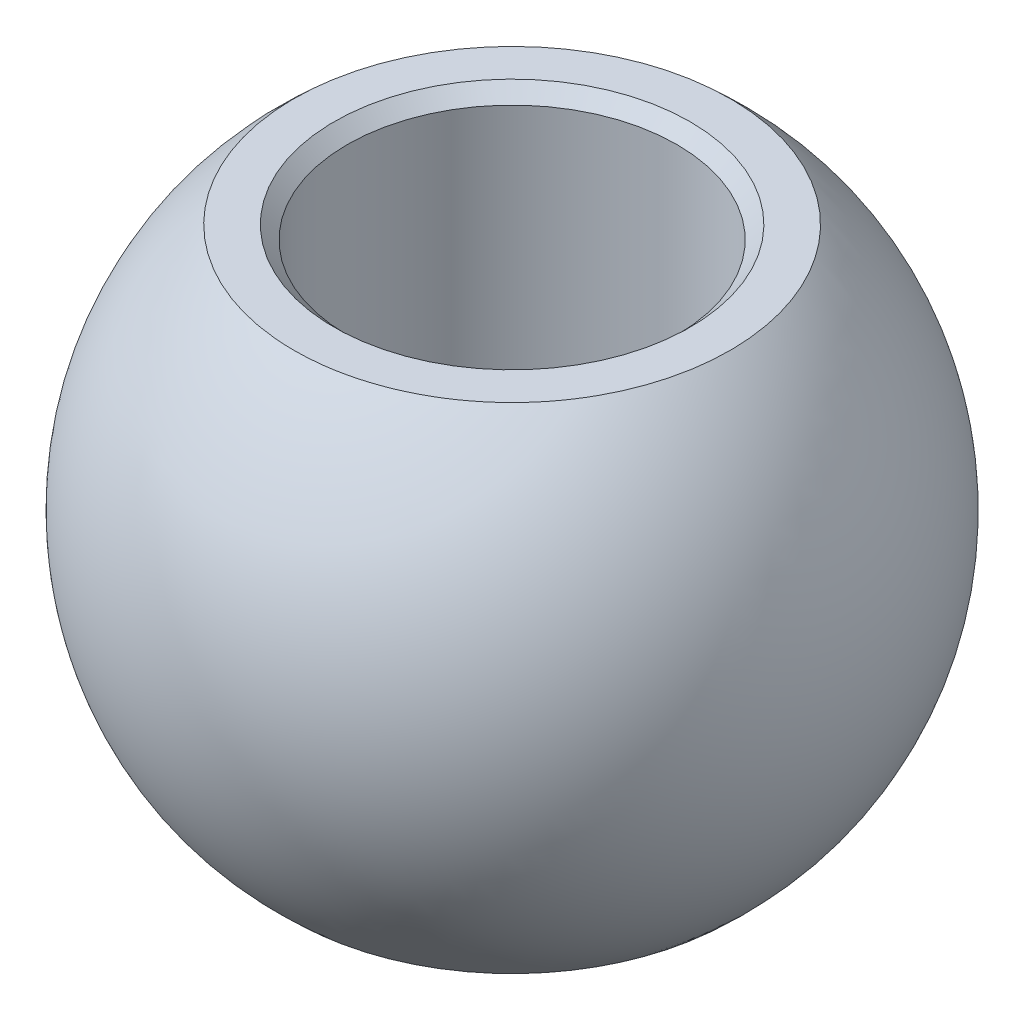
ISO-10303-21;
HEADER;
FILE_DESCRIPTION(('STEP AP214'),'2;1');
FILE_NAME('part.step','',(''),(''),'','','');
FILE_SCHEMA(('AUTOMOTIVE_DESIGN { 1 0 10303 214 1 1 1 1 }'));
ENDSEC;
DATA;
#1=APPLICATION_CONTEXT('core data for automotive mechanical design processes');
#2=APPLICATION_PROTOCOL_DEFINITION('international standard','automotive_design',2000,#1);
#3=PRODUCT_CONTEXT('',#1,'mechanical');
#4=PRODUCT('Part','Part','',(#3));
#5=PRODUCT_RELATED_PRODUCT_CATEGORY('part','',(#4));
#6=PRODUCT_DEFINITION_FORMATION('','',#4);
#7=PRODUCT_DEFINITION_CONTEXT('part definition',#1,'design');
#8=PRODUCT_DEFINITION('design','',#6,#7);
#9=PRODUCT_DEFINITION_SHAPE('','',#8);
#10=(LENGTH_UNIT() NAMED_UNIT(*) SI_UNIT(.MILLI.,.METRE.));
#11=(NAMED_UNIT(*) PLANE_ANGLE_UNIT() SI_UNIT($,.RADIAN.));
#12=(NAMED_UNIT(*) SI_UNIT($,.STERADIAN.) SOLID_ANGLE_UNIT());
#13=UNCERTAINTY_MEASURE_WITH_UNIT(LENGTH_MEASURE(1.E-05),#10,'distance_accuracy_value','');
#14=(GEOMETRIC_REPRESENTATION_CONTEXT(3) GLOBAL_UNCERTAINTY_ASSIGNED_CONTEXT((#13)) GLOBAL_UNIT_ASSIGNED_CONTEXT((#10,
#11,#12)) REPRESENTATION_CONTEXT('',''));
#15=CARTESIAN_POINT('',(0.,0.,0.));
#16=DIRECTION('',(0.,0.,1.));
#17=DIRECTION('',(1.,0.,0.));
#18=AXIS2_PLACEMENT_3D('',#15,#16,#17);
#19=CARTESIAN_POINT('',(0.,4.7625,39.6748));
#20=DIRECTION('',(0.,-1.,0.));
#21=DIRECTION('',(0.,0.,-1.));
#22=AXIS2_PLACEMENT_3D('',#19,#20,#21);
#23=PLANE('',#22);
#24=CARTESIAN_POINT('',(0.,4.7625,39.6748));
#25=DIRECTION('',(0.,-1.,0.));
#26=DIRECTION('',(0.,0.,-1.));
#27=AXIS2_PLACEMENT_3D('',#24,#25,#26);
#28=CIRCLE('',#27,3.42899999998385);
#29=CARTESIAN_POINT('',(0.,4.7625,36.2458000000161));
#30=VERTEX_POINT('',#29);
#31=EDGE_CURVE('E12',#30,#30,#28,.T.);
#32=ORIENTED_EDGE('',*,*,#31,.T.);
#33=EDGE_LOOP('',(#32));
#34=FACE_BOUND('',#33,.T.);
#35=CARTESIAN_POINT('',(0.,4.7625,43.874930206315));
#36=CARTESIAN_POINT('',(-0.117926484560648,4.7625,43.8749294996594));
#37=CARTESIAN_POINT('',(-0.235874641254159,4.7625,43.8699592573751));
#38=CARTESIAN_POINT('',(-0.470955861004184,4.7625,43.8501106007492));
#39=CARTESIAN_POINT('',(-0.588088673100284,4.7625,43.8352292612048));
#40=CARTESIAN_POINT('',(-0.820881455214088,4.7625,43.7956253651789));
#41=CARTESIAN_POINT('',(-0.936538785047837,4.7625,43.770887186888));
#42=CARTESIAN_POINT('',(-1.16542262835763,4.7625,43.7117401250278));
#43=CARTESIAN_POINT('',(-1.27864708861528,4.7625,43.6773233936185));
#44=CARTESIAN_POINT('',(-1.61297348901639,4.7625,43.5600312715043));
#45=CARTESIAN_POINT('',(-1.82929109201933,4.7625,43.4630176106887));
#46=CARTESIAN_POINT('',(-2.24254482911472,4.7625,43.2339987536841));
#47=CARTESIAN_POINT('',(-2.43948022604492,4.7625,43.1019922273182));
#48=CARTESIAN_POINT('',(-2.71606737206159,4.7625,42.8807445651986));
#49=CARTESIAN_POINT('',(-2.80517919807281,4.7625,42.8030639527833));
#50=CARTESIAN_POINT('',(-2.97648149360182,4.7625,42.6405310172082));
#51=CARTESIAN_POINT('',(-3.05867855351258,4.7625,42.5556856808685));
#52=CARTESIAN_POINT('',(-3.21566582479757,4.7625,42.3793397846612));
#53=CARTESIAN_POINT('',(-3.29045266406456,4.7625,42.2878362274435));
#54=CARTESIAN_POINT('',(-3.43207083285624,4.7625,42.0988316530998));
#55=CARTESIAN_POINT('',(-3.49890031578301,4.76249999999999,42.0013292518029));
#56=CARTESIAN_POINT('',(-3.62408488645376,4.76249999999999,41.8010740012385));
#57=CARTESIAN_POINT('',(-3.68244282868453,4.7625,41.6983229363588));
#58=CARTESIAN_POINT('',(-3.79031685235155,4.7625,41.4882338986538));
#59=CARTESIAN_POINT('',(-3.83982966775092,4.7625,41.3808942495633));
#60=CARTESIAN_POINT('',(-3.92961805965569,4.7625,41.1624585614712));
#61=CARTESIAN_POINT('',(-3.96989715669366,4.7625,41.051363972712));
#62=CARTESIAN_POINT('',(-4.04096740989928,4.7625,40.8261648063783));
#63=CARTESIAN_POINT('',(-4.07175500997036,4.76249999999998,40.712059118001));
#64=CARTESIAN_POINT('',(-4.1494826483622,4.76249999999998,40.3665383252836));
#65=CARTESIAN_POINT('',(-4.18188464233577,4.7625,40.1316825546638));
#66=CARTESIAN_POINT('',(-4.20674194830698,4.76249999999999,39.6598664500431));
#67=CARTESIAN_POINT('',(-4.19919726030462,4.76249999999995,39.4229061160422));
#68=CARTESIAN_POINT('',(-4.15820619108131,4.76249999999997,39.0711307101168));
#69=CARTESIAN_POINT('',(-4.13957890770973,4.76249999999999,38.9544216326961));
#70=CARTESIAN_POINT('',(-4.09256533770934,4.7625,38.7230013016016));
#71=CARTESIAN_POINT('',(-4.06418270421069,4.7625,38.608289316938));
#72=CARTESIAN_POINT('',(-3.99784393162879,4.7625,38.3816281768953));
#73=CARTESIAN_POINT('',(-3.95988413911526,4.76250000000002,38.2696800938033));
#74=CARTESIAN_POINT('',(-3.8746828144652,4.76249999999998,38.0494190145728));
#75=CARTESIAN_POINT('',(-3.82744470642194,4.76249999999992,37.941104694634));
#76=CARTESIAN_POINT('',(-3.72399535984851,4.76249999999993,37.7288040238715));
#77=CARTESIAN_POINT('',(-3.66778109513568,4.76249999999998,37.6248191476168));
#78=CARTESIAN_POINT('',(-3.54680693840993,4.76250000000002,37.4219800777628));
#79=CARTESIAN_POINT('',(-3.48204902821681,4.76249999999999,37.3231247016902));
#80=CARTESIAN_POINT('',(-3.34446071544949,4.7625,37.1312592940615));
#81=CARTESIAN_POINT('',(-3.2716339812673,4.76250000000003,37.0382466360792));
#82=CARTESIAN_POINT('',(-3.11835846692702,4.76249999999997,36.8586135425138));
#83=CARTESIAN_POINT('',(-3.0379023987059,4.76249999999987,36.7719993625739));
#84=CARTESIAN_POINT('',(-2.78609444631257,4.76249999999979,36.5229135692285));
#85=CARTESIAN_POINT('',(-2.6041201106219,4.76250000000003,36.3709444450052));
#86=CARTESIAN_POINT('',(-2.21721871431337,4.76249999999997,36.0997699668154));
#87=CARTESIAN_POINT('',(-2.01229252654783,4.76249999999966,35.9805633674945));
#88=CARTESIAN_POINT('',(-1.69214162632169,4.7624999999998,35.8287905603135));
#89=CARTESIAN_POINT('',(-1.58316037186452,4.76249999999995,35.7826670741218));
#90=CARTESIAN_POINT('',(-1.36175860205066,4.76250000000005,35.6997970253812));
#91=CARTESIAN_POINT('',(-1.24934095317315,4.76249999999999,35.6630428741833));
#92=CARTESIAN_POINT('',(-1.02199834753086,4.76250000000001,35.5991970626959));
#93=CARTESIAN_POINT('',(-0.907077657826551,4.76250000000008,35.5720901445003));
#94=CARTESIAN_POINT('',(-0.67538346253265,4.76249999999992,35.5276497471559));
#95=CARTESIAN_POINT('',(-0.558610513885609,4.76249999999968,35.5103133853682));
#96=CARTESIAN_POINT('',(-0.36804714736754,4.76249999999978,35.4901769434643));
#97=CARTESIAN_POINT('',(-0.294561834944511,4.76249999999994,35.4843636025291));
#98=CARTESIAN_POINT('',(-0.147387169762472,4.76250000000006,35.4766098068282));
#99=CARTESIAN_POINT('',(-0.0736978170034627,4.76250000000002,35.4746693520625));
#100=CARTESIAN_POINT('',(0.117926484560658,4.76249999999997,35.4746705003406));
#101=CARTESIAN_POINT('',(0.235874641254178,4.76249999999999,35.4796407426249));
#102=CARTESIAN_POINT('',(0.470955861004222,4.76250000000001,35.4994893992508));
#103=CARTESIAN_POINT('',(0.588088673100333,4.76249999999999,35.5143707387953));
#104=CARTESIAN_POINT('',(0.820881455214148,4.7625,35.5539746348211));
#105=CARTESIAN_POINT('',(0.936538785047899,4.76250000000003,35.578712813112));
#106=CARTESIAN_POINT('',(1.16542262835771,4.76249999999997,35.6378598749722));
#107=CARTESIAN_POINT('',(1.27864708861537,4.76249999999989,35.6722766063815));
#108=CARTESIAN_POINT('',(1.61297348901651,4.76249999999981,35.7895687284957));
#109=CARTESIAN_POINT('',(1.82929109201943,4.76249999999998,35.8865823893113));
#110=CARTESIAN_POINT('',(2.24254482911484,4.76250000000002,36.115601246316));
#111=CARTESIAN_POINT('',(2.43948022604509,4.76249999999989,36.2476077726818));
#112=CARTESIAN_POINT('',(2.71606737206175,4.76249999999993,36.4688554348015));
#113=CARTESIAN_POINT('',(2.80517919807295,4.76249999999998,36.5465360472168));
#114=CARTESIAN_POINT('',(2.97648149360194,4.76250000000002,36.7090689827919));
#115=CARTESIAN_POINT('',(3.0586785535127,4.7625,36.7939143191316));
#116=CARTESIAN_POINT('',(3.21566582479769,4.7625,36.970260215339));
#117=CARTESIAN_POINT('',(3.29045266406469,4.76250000000001,37.0617637725567));
#118=CARTESIAN_POINT('',(3.43207083285636,4.76249999999999,37.2507683469003));
#119=CARTESIAN_POINT('',(3.49890031578313,4.76249999999996,37.3482707481972));
#120=CARTESIAN_POINT('',(3.62408488645387,4.76249999999996,37.5485259987617));
#121=CARTESIAN_POINT('',(3.68244282868462,4.76249999999999,37.6512770636414));
#122=CARTESIAN_POINT('',(3.79031685235163,4.76250000000001,37.8613661013464));
#123=CARTESIAN_POINT('',(3.839829667751,4.7625,37.9687057504369));
#124=CARTESIAN_POINT('',(3.92961805965576,4.7625,38.187141438529));
#125=CARTESIAN_POINT('',(3.96989715669373,4.7625,38.2982360272882));
#126=CARTESIAN_POINT('',(4.04096740989934,4.76249999999999,38.5234351936219));
#127=CARTESIAN_POINT('',(4.07175500997042,4.76249999999998,38.6375408819992));
#128=CARTESIAN_POINT('',(4.14948264836224,4.76249999999996,38.9830616747166));
#129=CARTESIAN_POINT('',(4.1818846423358,4.76249999999999,39.2179174453364));
#130=CARTESIAN_POINT('',(4.20674194830698,4.76250000000001,39.6897335499571));
#131=CARTESIAN_POINT('',(4.19919726030458,4.76249999999999,39.926693883958));
#132=CARTESIAN_POINT('',(4.15820619108126,4.76249999999999,40.2784692898834));
#133=CARTESIAN_POINT('',(4.13957890770969,4.7625,40.3951783673041));
#134=CARTESIAN_POINT('',(4.0925653377093,4.7625,40.6265986983986));
#135=CARTESIAN_POINT('',(4.06418270421063,4.7625,40.7413106830622));
#136=CARTESIAN_POINT('',(3.99784393162873,4.7625,40.9679718231049));
#137=CARTESIAN_POINT('',(3.9598841391152,4.7625,41.0799199061969));
#138=CARTESIAN_POINT('',(3.8746828144651,4.7625,41.3001809854274));
#139=CARTESIAN_POINT('',(3.82744470642181,4.76249999999999,41.4084953053662));
#140=CARTESIAN_POINT('',(3.72399535984838,4.76249999999999,41.6207959761287));
#141=CARTESIAN_POINT('',(3.66778109513556,4.7625,41.7247808523834));
#142=CARTESIAN_POINT('',(3.54680693840981,4.7625,41.9276199222374));
#143=CARTESIAN_POINT('',(3.48204902821668,4.7625,42.02647529831));
#144=CARTESIAN_POINT('',(3.34446071544936,4.7625,42.2183407059387));
#145=CARTESIAN_POINT('',(3.27163398126717,4.7625,42.311353363921));
#146=CARTESIAN_POINT('',(3.11835846692685,4.7625,42.4909864574864));
#147=CARTESIAN_POINT('',(3.03790239870568,4.7625,42.5776006374262));
#148=CARTESIAN_POINT('',(2.7860944463123,4.7625,42.8266864307716));
#149=CARTESIAN_POINT('',(2.60412011062172,4.7625,42.978655554995));
#150=CARTESIAN_POINT('',(2.21721871431317,4.7625,43.2498300331848));
#151=CARTESIAN_POINT('',(2.01229252654752,4.7625,43.3690366325055));
#152=CARTESIAN_POINT('',(1.6921416263214,4.7625,43.5208094396866));
#153=CARTESIAN_POINT('',(1.58316037186425,4.7625,43.5669329258783));
#154=CARTESIAN_POINT('',(1.36175860205042,4.7625,43.6498029746189));
#155=CARTESIAN_POINT('',(1.2493409531729,4.7625,43.6865571258168));
#156=CARTESIAN_POINT('',(1.02199834753061,4.7625,43.7504029373042));
#157=CARTESIAN_POINT('',(0.907077657826312,4.7625,43.7775098554998));
#158=CARTESIAN_POINT('',(0.675383462532398,4.7625,43.8219502528441));
#159=CARTESIAN_POINT('',(0.558610513885334,4.7625,43.8392866146317));
#160=CARTESIAN_POINT('',(0.368047147367306,4.7625,43.8594230565356));
#161=CARTESIAN_POINT('',(0.294561834944329,4.7625,43.8652363974709));
#162=CARTESIAN_POINT('',(0.147387169762386,4.7625,43.8729901931718));
#163=CARTESIAN_POINT('',(0.073697817003421,4.7625,43.8749306479375));
#164=CARTESIAN_POINT('',(0.,4.7625,43.874930206315));
#165=B_SPLINE_CURVE_WITH_KNOTS('',3,(#35,#36,#37,#38,#39,#40,#41,#42,#43,#44,#45,#46,#47,#48,
#49,#50,#51,#52,#53,#54,#55,#56,#57,#58,#59,#60,#61,#62,#63,#64,#65,#66,#67,#68,#69,#70,#71,#72,
#73,#74,#75,#76,#77,#78,#79,#80,#81,#82,#83,#84,#85,#86,#87,#88,#89,#90,#91,#92,#93,#94,#95,#96,
#97,#98,#99,#100,#101,#102,#103,#104,#105,#106,#107,#108,#109,#110,#111,#112,#113,#114,#115,
#116,#117,#118,#119,#120,#121,#122,#123,#124,#125,#126,#127,#128,#129,#130,#131,#132,#133,#134,
#135,#136,#137,#138,#139,#140,#141,#142,#143,#144,#145,#146,#147,#148,#149,#150,#151,#152,#153,
#154,#155,#156,#157,#158,#159,#160,#161,#162,#163,#164),.UNSPECIFIED.,.T.,.F.,(4,2,2,2,2,2,2,2,
2,2,2,2,2,2,2,2,2,2,2,2,2,2,2,2,2,2,2,2,2,2,2,2,2,2,2,2,2,2,2,2,2,2,2,2,2,2,2,2,2,2,2,2,2,2,2,2,
2,2,2,2,2,2,2,2,4),(0.,0.353711607909462,0.707527658036076,1.06190670544321,1.41657393321628,
2.12421773198894,2.8318884341422,3.18618744171492,3.54014485168143,3.89426260138645,
4.24846236876854,4.60254251007932,4.95675312540429,5.31082846567948,5.66503630351361,
6.37269355397748,7.08035080444134,7.43455864227549,7.78863398255066,8.14284459787563,
8.49692473918641,8.85112450656849,9.20524225627351,9.55919966624002,9.91349867381274,
10.621169375966,11.3288131747386,11.6834804025117,12.0378594499189,12.3916755000455,
12.7453871079549,12.9664381589452,13.1874892099354,13.5412008178449,13.8950168679715,
14.2493959153787,14.6040631431517,15.3117069419244,16.0193776440778,16.3736766516505,
16.727634061617,17.081751811322,17.4359515787041,17.7900317200149,18.1442423353399,
18.4983176756151,18.8525255134492,19.5601827639131,20.267840014377,20.6220478522111,
20.9761231924863,21.3303338078112,21.684413949122,22.0386137165041,22.3927314662091,
22.7466888761756,23.1009878837484,23.8086585859016,24.5163023846743,24.8709696124474,
25.2253486598545,25.5791647099811,25.9328763178905,26.1539273688806,26.3749784198707),.UNSPECIFIED.);
#166=CARTESIAN_POINT('',(0.,4.7625,43.874930206315));
#167=VERTEX_POINT('',#166);
#168=EDGE_CURVE('E82',#167,#167,#165,.T.);
#169=ORIENTED_EDGE('',*,*,#168,.F.);
#170=EDGE_LOOP('',(#169));
#171=FACE_BOUND('',#170,.T.);
#172=ADVANCED_FACE('F41',(#34,#171),#23,.F.);
#173=CARTESIAN_POINT('',(0.,-4.7625,39.6748));
#174=DIRECTION('',(0.,1.,0.));
#175=DIRECTION('',(0.,0.,1.));
#176=AXIS2_PLACEMENT_3D('',#173,#174,#175);
#177=PLANE('',#176);
#178=CARTESIAN_POINT('',(0.,-4.7625,39.6748));
#179=DIRECTION('',(0.,1.,0.));
#180=DIRECTION('',(0.,0.,1.));
#181=AXIS2_PLACEMENT_3D('',#178,#179,#180);
#182=CIRCLE('',#181,3.42899999998385);
#183=CARTESIAN_POINT('',(0.,-4.7625,43.1037999999838));
#184=VERTEX_POINT('',#183);
#185=EDGE_CURVE('E94',#184,#184,#182,.T.);
#186=ORIENTED_EDGE('',*,*,#185,.T.);
#187=EDGE_LOOP('',(#186));
#188=FACE_BOUND('',#187,.T.);
#189=CARTESIAN_POINT('',(0.,-4.7625,35.474669793685));
#190=CARTESIAN_POINT('',(-0.117926484560649,-4.76249999999999,35.4746705003406));
#191=CARTESIAN_POINT('',(-0.235874641254159,-4.7625,35.4796407426249));
#192=CARTESIAN_POINT('',(-0.470955861004182,-4.7625,35.4994893992508));
#193=CARTESIAN_POINT('',(-0.588088673100283,-4.7625,35.5143707387952));
#194=CARTESIAN_POINT('',(-0.820881455214087,-4.7625,35.5539746348211));
#195=CARTESIAN_POINT('',(-0.936538785047836,-4.7625,35.578712813112));
#196=CARTESIAN_POINT('',(-1.16542262835763,-4.7625,35.6378598749722));
#197=CARTESIAN_POINT('',(-1.27864708861528,-4.76249999999999,35.6722766063815));
#198=CARTESIAN_POINT('',(-1.61297348901639,-4.76249999999999,35.7895687284958));
#199=CARTESIAN_POINT('',(-1.82929109201934,-4.7625,35.8865823893113));
#200=CARTESIAN_POINT('',(-2.24254482911472,-4.7625,36.1156012463159));
#201=CARTESIAN_POINT('',(-2.43948022604491,-4.7625,36.2476077726818));
#202=CARTESIAN_POINT('',(-2.71606737206159,-4.7625,36.4688554348014));
#203=CARTESIAN_POINT('',(-2.80517919807282,-4.7625,36.5465360472167));
#204=CARTESIAN_POINT('',(-2.97648149360182,-4.7625,36.7090689827918));
#205=CARTESIAN_POINT('',(-3.05867855351258,-4.7625,36.7939143191315));
#206=CARTESIAN_POINT('',(-3.21566582479757,-4.7625,36.9702602153388));
#207=CARTESIAN_POINT('',(-3.29045266406457,-4.7625,37.0617637725565));
#208=CARTESIAN_POINT('',(-3.43207083285624,-4.7625,37.2507683469002));
#209=CARTESIAN_POINT('',(-3.498900315783,-4.7625,37.3482707481971));
#210=CARTESIAN_POINT('',(-3.62408488645375,-4.7625,37.5485259987615));
#211=CARTESIAN_POINT('',(-3.68244282868452,-4.7625,37.6512770636412));
#212=CARTESIAN_POINT('',(-3.79031685235155,-4.7625,37.8613661013462));
#213=CARTESIAN_POINT('',(-3.83982966775091,-4.7625,37.9687057504367));
#214=CARTESIAN_POINT('',(-3.92961805965569,-4.7625,38.1871414385288));
#215=CARTESIAN_POINT('',(-3.96989715669366,-4.7625,38.298236027288));
#216=CARTESIAN_POINT('',(-4.04096740989928,-4.7625,38.5234351936217));
#217=CARTESIAN_POINT('',(-4.07175500997036,-4.7625,38.637540881999));
#218=CARTESIAN_POINT('',(-4.14948264836218,-4.7625,38.9830616747165));
#219=CARTESIAN_POINT('',(-4.18188464233577,-4.7625,39.2179174453362));
#220=CARTESIAN_POINT('',(-4.20674194830698,-4.7625,39.6897335499569));
#221=CARTESIAN_POINT('',(-4.1991972603046,-4.7625,39.9266938839578));
#222=CARTESIAN_POINT('',(-4.15820619108129,-4.7625,40.2784692898832));
#223=CARTESIAN_POINT('',(-4.13957890770972,-4.7625,40.3951783673039));
#224=CARTESIAN_POINT('',(-4.09256533770934,-4.7625,40.6265986983984));
#225=CARTESIAN_POINT('',(-4.06418270421069,-4.7625,40.741310683062));
#226=CARTESIAN_POINT('',(-3.9978439316288,-4.7625,40.9679718231047));
#227=CARTESIAN_POINT('',(-3.95988413911527,-4.7625,41.0799199061967));
#228=CARTESIAN_POINT('',(-3.87468281446519,-4.76249999999999,41.3001809854272));
#229=CARTESIAN_POINT('',(-3.82744470642191,-4.76249999999998,41.408495305366));
#230=CARTESIAN_POINT('',(-3.72399535984848,-4.76249999999998,41.6207959761285));
#231=CARTESIAN_POINT('',(-3.66778109513566,-4.76249999999999,41.7247808523832));
#232=CARTESIAN_POINT('',(-3.54680693840992,-4.7625,41.9276199222372));
#233=CARTESIAN_POINT('',(-3.48204902821679,-4.7625,42.0264752983098));
#234=CARTESIAN_POINT('',(-3.34446071544948,-4.7625,42.2183407059385));
#235=CARTESIAN_POINT('',(-3.27163398126729,-4.7625,42.3113533639208));
#236=CARTESIAN_POINT('',(-3.11835846692698,-4.7625,42.4909864574862));
#237=CARTESIAN_POINT('',(-3.03790239870582,-4.76249999999999,42.5776006374261));
#238=CARTESIAN_POINT('',(-2.78609444631246,-4.76249999999998,42.8266864307715));
#239=CARTESIAN_POINT('',(-2.60412011062187,-4.76250000000001,42.9786555549949));
#240=CARTESIAN_POINT('',(-2.21721871431333,-4.76249999999999,43.2498300331846));
#241=CARTESIAN_POINT('',(-2.0122925265477,-4.76249999999995,43.3690366325054));
#242=CARTESIAN_POINT('',(-1.69214162632159,-4.76249999999997,43.5208094396865));
#243=CARTESIAN_POINT('',(-1.58316037186444,-4.76249999999999,43.5669329258782));
#244=CARTESIAN_POINT('',(-1.3617586020506,-4.7625,43.6498029746188));
#245=CARTESIAN_POINT('',(-1.24934095317309,-4.7625,43.6865571258167));
#246=CARTESIAN_POINT('',(-1.0219983475308,-4.7625,43.7504029373041));
#247=CARTESIAN_POINT('',(-0.907077657826499,-4.76250000000002,43.7775098554997));
#248=CARTESIAN_POINT('',(-0.675383462532587,-4.76249999999998,43.821950252844));
#249=CARTESIAN_POINT('',(-0.558610513885528,-4.76249999999992,43.8392866146317));
#250=CARTESIAN_POINT('',(-0.368047147367467,-4.76249999999995,43.8594230565356));
#251=CARTESIAN_POINT('',(-0.294561834944455,-4.76249999999998,43.8652363974709));
#252=CARTESIAN_POINT('',(-0.147387169762445,-4.76250000000002,43.8729901931718));
#253=CARTESIAN_POINT('',(-0.0736978170034471,-4.76250000000001,43.8749306479375));
#254=CARTESIAN_POINT('',(0.117926484560652,-4.7625,43.8749294996594));
#255=CARTESIAN_POINT('',(0.23587464125416,-4.7625,43.8699592573751));
#256=CARTESIAN_POINT('',(0.470955861004181,-4.7625,43.8501106007492));
#257=CARTESIAN_POINT('',(0.588088673100281,-4.76249999999999,43.8352292612048));
#258=CARTESIAN_POINT('',(0.820881455214073,-4.76250000000001,43.7956253651789));
#259=CARTESIAN_POINT('',(0.936538785047813,-4.76250000000004,43.770887186888));
#260=CARTESIAN_POINT('',(1.16542262835761,-4.76249999999996,43.7117401250278));
#261=CARTESIAN_POINT('',(1.27864708861528,-4.76249999999985,43.6773233936186));
#262=CARTESIAN_POINT('',(1.61297348901639,-4.76249999999976,43.5600312715044));
#263=CARTESIAN_POINT('',(1.82929109201926,-4.76250000000003,43.4630176106887));
#264=CARTESIAN_POINT('',(2.24254482911467,-4.76249999999997,43.2339987536842));
#265=CARTESIAN_POINT('',(2.43948022604496,-4.76249999999965,43.1019922273184));
#266=CARTESIAN_POINT('',(2.71606737206156,-4.7624999999998,42.8807445651988));
#267=CARTESIAN_POINT('',(2.80517919807273,-4.76249999999995,42.8030639527835));
#268=CARTESIAN_POINT('',(2.97648149360171,-4.76250000000005,42.6405310172083));
#269=CARTESIAN_POINT('',(3.0586785535125,-4.7625,42.5556856808686));
#270=CARTESIAN_POINT('',(3.21566582479749,-4.7625,42.3793397846613));
#271=CARTESIAN_POINT('',(3.29045266406447,-4.76250000000006,42.2878362274435));
#272=CARTESIAN_POINT('',(3.43207083285621,-4.76249999999994,42.0988316530999));
#273=CARTESIAN_POINT('',(3.49890031578306,-4.76249999999975,42.0013292518031));
#274=CARTESIAN_POINT('',(3.62408488645381,-4.76249999999975,41.8010740012386));
#275=CARTESIAN_POINT('',(3.68244282868449,-4.76249999999994,41.6983229363589));
#276=CARTESIAN_POINT('',(3.79031685235147,-4.76250000000006,41.4882338986539));
#277=CARTESIAN_POINT('',(3.83982966775087,-4.76250000000001,41.3808942495634));
#278=CARTESIAN_POINT('',(3.92961805965566,-4.76249999999999,41.1624585614713));
#279=CARTESIAN_POINT('',(3.96989715669361,-4.76250000000003,41.051363972712));
#280=CARTESIAN_POINT('',(4.04096740989927,-4.76249999999997,40.8261648063784));
#281=CARTESIAN_POINT('',(4.0717550099704,-4.76249999999988,40.7120591180011));
#282=CARTESIAN_POINT('',(4.1494826483623,-4.76249999999978,40.3665383252837));
#283=CARTESIAN_POINT('',(4.18188464233578,-4.76249999999997,40.1316825546639));
#284=CARTESIAN_POINT('',(4.20674194830696,-4.76250000000003,39.6598664500432));
#285=CARTESIAN_POINT('',(4.19919726030466,-4.7624999999999,39.4229061160423));
#286=CARTESIAN_POINT('',(4.15820619108134,-4.76249999999993,39.0711307101169));
#287=CARTESIAN_POINT('',(4.13957890770974,-4.76249999999998,38.9544216326961));
#288=CARTESIAN_POINT('',(4.09256533770935,-4.76250000000002,38.7230013016016));
#289=CARTESIAN_POINT('',(4.0641827042107,-4.7625,38.608289316938));
#290=CARTESIAN_POINT('',(3.99784393162881,-4.7625,38.3816281768954));
#291=CARTESIAN_POINT('',(3.95988413911528,-4.76250000000001,38.2696800938034));
#292=CARTESIAN_POINT('',(3.8746828144652,-4.76249999999999,38.0494190145728));
#293=CARTESIAN_POINT('',(3.82744470642194,-4.76249999999995,37.941104694634));
#294=CARTESIAN_POINT('',(3.72399535984851,-4.76249999999995,37.7288040238716));
#295=CARTESIAN_POINT('',(3.66778109513569,-4.76249999999999,37.6248191476168));
#296=CARTESIAN_POINT('',(3.54680693840994,-4.76250000000001,37.4219800777628));
#297=CARTESIAN_POINT('',(3.48204902821681,-4.7625,37.3231247016902));
#298=CARTESIAN_POINT('',(3.3444607154495,-4.7625,37.1312592940615));
#299=CARTESIAN_POINT('',(3.27163398126731,-4.7625,37.0382466360792));
#300=CARTESIAN_POINT('',(3.118358466927,-4.76249999999999,36.8586135425138));
#301=CARTESIAN_POINT('',(3.03790239870585,-4.76249999999998,36.7719993625739));
#302=CARTESIAN_POINT('',(2.78609444631249,-4.76249999999996,36.5229135692285));
#303=CARTESIAN_POINT('',(2.6041201106219,-4.76249999999999,36.3709444450052));
#304=CARTESIAN_POINT('',(2.21721871431336,-4.7625,36.0997699668154));
#305=CARTESIAN_POINT('',(2.01229252654772,-4.76249999999998,35.9805633674946));
#306=CARTESIAN_POINT('',(1.69214162632161,-4.76249999999999,35.8287905603135));
#307=CARTESIAN_POINT('',(1.58316037186446,-4.7625,35.7826670741218));
#308=CARTESIAN_POINT('',(1.36175860205063,-4.7625,35.6997970253812));
#309=CARTESIAN_POINT('',(1.24934095317311,-4.7625,35.6630428741833));
#310=CARTESIAN_POINT('',(1.02199834753083,-4.7625,35.5991970626959));
#311=CARTESIAN_POINT('',(0.907077657826533,-4.7625,35.5720901445003));
#312=CARTESIAN_POINT('',(0.675383462532618,-4.7625,35.527649747156));
#313=CARTESIAN_POINT('',(0.558610513885552,-4.76249999999999,35.5103133853684));
#314=CARTESIAN_POINT('',(0.368047147367486,-4.76249999999999,35.4901769434644));
#315=CARTESIAN_POINT('',(0.294561834944473,-4.7625,35.4843636025291));
#316=CARTESIAN_POINT('',(0.147387169762458,-4.7625,35.4766098068282));
#317=CARTESIAN_POINT('',(0.0736978170034563,-4.7625,35.4746693520625));
#318=CARTESIAN_POINT('',(0.,-4.7625,35.474669793685));
#319=B_SPLINE_CURVE_WITH_KNOTS('',3,(#189,#190,#191,#192,#193,#194,#195,#196,#197,#198,#199,
#200,#201,#202,#203,#204,#205,#206,#207,#208,#209,#210,#211,#212,#213,#214,#215,#216,#217,#218,
#219,#220,#221,#222,#223,#224,#225,#226,#227,#228,#229,#230,#231,#232,#233,#234,#235,#236,#237,
#238,#239,#240,#241,#242,#243,#244,#245,#246,#247,#248,#249,#250,#251,#252,#253,#254,#255,#256,
#257,#258,#259,#260,#261,#262,#263,#264,#265,#266,#267,#268,#269,#270,#271,#272,#273,#274,#275,
#276,#277,#278,#279,#280,#281,#282,#283,#284,#285,#286,#287,#288,#289,#290,#291,#292,#293,#294,
#295,#296,#297,#298,#299,#300,#301,#302,#303,#304,#305,#306,#307,#308,#309,#310,#311,#312,#313,
#314,#315,#316,#317,#318),.UNSPECIFIED.,.T.,.F.,(4,2,2,2,2,2,2,2,2,2,2,2,2,2,2,2,2,2,2,2,2,2,2,
2,2,2,2,2,2,2,2,2,2,2,2,2,2,2,2,2,2,2,2,2,2,2,2,2,2,2,2,2,2,2,2,2,2,2,2,2,2,2,2,2,4),(0.,
0.353711607909461,0.707527658036073,1.0619067054432,1.41657393321628,2.12421773198894,
2.8318884341422,3.18618744171492,3.54014485168143,3.89426260138645,4.24846236876854,
4.60254251007931,4.95675312540429,5.31082846567946,5.66503630351361,6.37269355397749,
7.08035080444137,7.4345586422755,7.78863398255067,8.14284459787563,8.49692473918641,
8.8511245065685,9.20524225627353,9.55919966624005,9.91349867381278,10.621169375966,
11.3288131747387,11.6834804025118,12.0378594499189,12.3916755000455,12.745387107955,
12.9664381589451,13.1874892099353,13.5412008178448,13.8950168679714,14.2493959153785,
14.6040631431516,15.3117069419242,16.0193776440774,16.3736766516502,16.7276340616167,
17.0817518113217,17.4359515787038,17.7900317200146,18.1442423353396,18.4983176756148,
18.8525255134489,19.5601827639128,20.2678400143767,20.6220478522109,20.976123192486,
21.330333807811,21.6844139491218,22.0386137165039,22.3927314662089,22.7466888761754,
23.1009878837481,23.8086585859014,24.5163023846741,24.8709696124471,25.2253486598543,
25.5791647099809,25.9328763178903,26.1539273688805,26.3749784198707),.UNSPECIFIED.);
#320=CARTESIAN_POINT('',(0.,-4.7625,35.474669793685));
#321=VERTEX_POINT('',#320);
#322=EDGE_CURVE('E89',#321,#321,#319,.T.);
#323=ORIENTED_EDGE('',*,*,#322,.F.);
#324=EDGE_LOOP('',(#323));
#325=FACE_BOUND('',#324,.T.);
#326=ADVANCED_FACE('F58',(#188,#325),#177,.F.);
#327=CARTESIAN_POINT('',(0.,0.,39.6748));
#328=DIRECTION('',(0.435993652138819,0.523682612185743,0.731892107478262));
#329=DIRECTION('',(-0.75128520509883,0.659528017124451,-0.0243584734230036));
#330=AXIS2_PLACEMENT_3D('',#327,#328,#329);
#331=SPHERICAL_SURFACE('',#330,6.35);
#332=ORIENTED_EDGE('',*,*,#168,.T.);
#333=EDGE_LOOP('',(#332));
#334=FACE_BOUND('',#333,.T.);
#335=CARTESIAN_POINT('',(-2.7685596910815,-3.32538458737947,35.027285117513));
#336=VERTEX_POINT('',#335);
#337=VERTEX_LOOP('',#336);
#338=FACE_BOUND('',#337,.T.);
#339=ORIENTED_EDGE('',*,*,#322,.T.);
#340=EDGE_LOOP('',(#339));
#341=FACE_BOUND('',#340,.T.);
#342=CARTESIAN_POINT('',(2.7685596910815,3.32538458737947,44.322314882487));
#343=VERTEX_POINT('',#342);
#344=VERTEX_LOOP('',#343);
#345=FACE_BOUND('',#344,.T.);
#346=ADVANCED_FACE('F55',(#334,#338,#341,#345),#331,.T.);
#347=CARTESIAN_POINT('',(0.,4.7625,39.6748));
#348=DIRECTION('',(0.,1.,0.));
#349=DIRECTION('',(0.,0.,1.));
#350=AXIS2_PLACEMENT_3D('',#347,#348,#349);
#351=CYLINDRICAL_SURFACE('',#350,3.17500000000001);
#352=CARTESIAN_POINT('',(0.,-4.50850000001616,39.6748));
#353=DIRECTION('',(0.,1.,0.));
#354=DIRECTION('',(0.,0.,1.));
#355=AXIS2_PLACEMENT_3D('',#352,#353,#354);
#356=CIRCLE('',#355,3.17500000000001);
#357=CARTESIAN_POINT('',(0.,-4.50850000001616,42.8498));
#358=VERTEX_POINT('',#357);
#359=EDGE_CURVE('E50',#358,#358,#356,.F.);
#360=ORIENTED_EDGE('',*,*,#359,.T.);
#361=EDGE_LOOP('',(#360));
#362=FACE_BOUND('',#361,.T.);
#363=CARTESIAN_POINT('',(0.,4.50850000001615,39.6748));
#364=DIRECTION('',(0.,-1.,0.));
#365=DIRECTION('',(0.,0.,-1.));
#366=AXIS2_PLACEMENT_3D('',#363,#364,#365);
#367=CIRCLE('',#366,3.17500000000001);
#368=CARTESIAN_POINT('',(0.,4.50850000001615,36.4998));
#369=VERTEX_POINT('',#368);
#370=EDGE_CURVE('E120',#369,#369,#367,.F.);
#371=ORIENTED_EDGE('',*,*,#370,.T.);
#372=EDGE_LOOP('',(#371));
#373=FACE_BOUND('',#372,.T.);
#374=ADVANCED_FACE('F57',(#362,#373),#351,.F.);
#375=CARTESIAN_POINT('',(0.,-4.7625,39.6748));
#376=DIRECTION('',(0.,-1.,0.));
#377=DIRECTION('',(0.,0.,-1.));
#378=AXIS2_PLACEMENT_3D('',#375,#376,#377);
#379=CONICAL_SURFACE('',#378,3.42899999998385,0.785398163397447);
#380=ORIENTED_EDGE('',*,*,#359,.F.);
#381=EDGE_LOOP('',(#380));
#382=FACE_BOUND('',#381,.T.);
#383=ORIENTED_EDGE('',*,*,#185,.F.);
#384=EDGE_LOOP('',(#383));
#385=FACE_BOUND('',#384,.T.);
#386=ADVANCED_FACE('F65',(#382,#385),#379,.F.);
#387=CARTESIAN_POINT('',(0.,4.50850000001615,39.6748));
#388=DIRECTION('',(0.,1.,0.));
#389=DIRECTION('',(0.,0.,1.));
#390=AXIS2_PLACEMENT_3D('',#387,#388,#389);
#391=CONICAL_SURFACE('',#390,3.17500000000001,0.785398163397448);
#392=ORIENTED_EDGE('',*,*,#31,.F.);
#393=EDGE_LOOP('',(#392));
#394=FACE_BOUND('',#393,.T.);
#395=ORIENTED_EDGE('',*,*,#370,.F.);
#396=EDGE_LOOP('',(#395));
#397=FACE_BOUND('',#396,.T.);
#398=ADVANCED_FACE('F43',(#394,#397),#391,.F.);
#399=CLOSED_SHELL('',(#172,#326,#346,#374,#386,#398));
#400=MANIFOLD_SOLID_BREP('B2',#399);
#401=ADVANCED_BREP_SHAPE_REPRESENTATION('',(#18,#400),#14);
#402=SHAPE_DEFINITION_REPRESENTATION(#9,#401);
ENDSEC;
END-ISO-10303-21;
